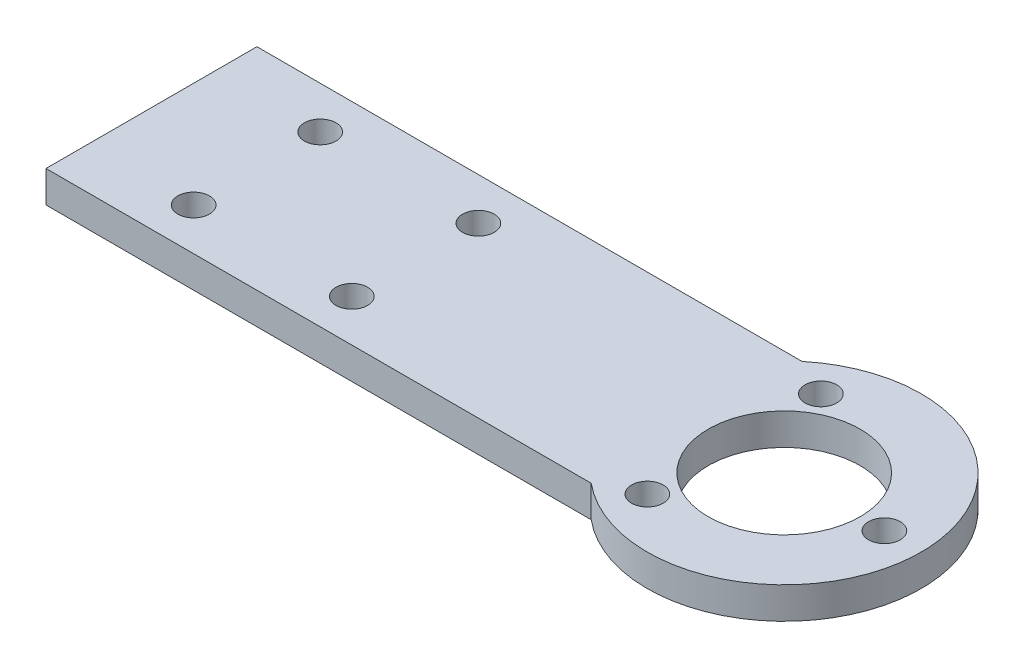
ISO-10303-21;
HEADER;
FILE_DESCRIPTION(('STEP AP214'),'2;1');
FILE_NAME('part.step','',(''),(''),'','','');
FILE_SCHEMA(('AUTOMOTIVE_DESIGN { 1 0 10303 214 1 1 1 1 }'));
ENDSEC;
DATA;
#1=APPLICATION_CONTEXT('core data for automotive mechanical design processes');
#2=APPLICATION_PROTOCOL_DEFINITION('international standard','automotive_design',2000,#1);
#3=PRODUCT_CONTEXT('',#1,'mechanical');
#4=PRODUCT('Part','Part','',(#3));
#5=PRODUCT_RELATED_PRODUCT_CATEGORY('part','',(#4));
#6=PRODUCT_DEFINITION_FORMATION('','',#4);
#7=PRODUCT_DEFINITION_CONTEXT('part definition',#1,'design');
#8=PRODUCT_DEFINITION('design','',#6,#7);
#9=PRODUCT_DEFINITION_SHAPE('','',#8);
#10=(LENGTH_UNIT() NAMED_UNIT(*) SI_UNIT(.MILLI.,.METRE.));
#11=(NAMED_UNIT(*) PLANE_ANGLE_UNIT() SI_UNIT($,.RADIAN.));
#12=(NAMED_UNIT(*) SI_UNIT($,.STERADIAN.) SOLID_ANGLE_UNIT());
#13=UNCERTAINTY_MEASURE_WITH_UNIT(LENGTH_MEASURE(1.E-05),#10,'distance_accuracy_value','');
#14=(GEOMETRIC_REPRESENTATION_CONTEXT(3) GLOBAL_UNCERTAINTY_ASSIGNED_CONTEXT((#13)) GLOBAL_UNIT_ASSIGNED_CONTEXT((#10,
#11,#12)) REPRESENTATION_CONTEXT('',''));
#15=CARTESIAN_POINT('',(0.,0.,0.));
#16=DIRECTION('',(0.,0.,1.));
#17=DIRECTION('',(1.,0.,0.));
#18=AXIS2_PLACEMENT_3D('',#15,#16,#17);
#19=CARTESIAN_POINT('',(1.41732283464566,3.,-1.5748031496063));
#20=DIRECTION('',(0.,1.,0.));
#21=DIRECTION('',(0.,0.,1.));
#22=AXIS2_PLACEMENT_3D('',#19,#20,#21);
#23=PLANE('',#22);
#24=CARTESIAN_POINT('',(-3.33267716535438,3.,6.65243818634584));
#25=DIRECTION('',(0.,1.,0.));
#26=DIRECTION('',(0.,0.,1.));
#27=AXIS2_PLACEMENT_3D('',#24,#25,#26);
#28=CIRCLE('',#27,1.5);
#29=CARTESIAN_POINT('',(-3.33267716535438,3.,8.15243818634584));
#30=VERTEX_POINT('',#29);
#31=EDGE_CURVE('E156',#30,#30,#28,.T.);
#32=ORIENTED_EDGE('',*,*,#31,.F.);
#33=EDGE_LOOP('',(#32));
#34=FACE_BOUND('',#33,.T.);
#35=CARTESIAN_POINT('',(-48.5826771653543,3.,4.4251968503937));
#36=DIRECTION('',(0.,1.,0.));
#37=DIRECTION('',(0.,0.,1.));
#38=AXIS2_PLACEMENT_3D('',#35,#36,#37);
#39=CIRCLE('',#38,1.5);
#40=CARTESIAN_POINT('',(-48.5826771653543,3.,5.9251968503937));
#41=VERTEX_POINT('',#40);
#42=EDGE_CURVE('E144',#41,#41,#39,.T.);
#43=ORIENTED_EDGE('',*,*,#42,.F.);
#44=EDGE_LOOP('',(#43));
#45=FACE_BOUND('',#44,.T.);
#46=CARTESIAN_POINT('',(-48.5826771653543,3.,-7.5748031496063));
#47=DIRECTION('',(0.,1.,0.));
#48=DIRECTION('',(0.,0.,1.));
#49=AXIS2_PLACEMENT_3D('',#46,#47,#48);
#50=CIRCLE('',#49,1.5);
#51=CARTESIAN_POINT('',(-48.5826771653543,3.,-6.0748031496063));
#52=VERTEX_POINT('',#51);
#53=EDGE_CURVE('E132',#52,#52,#50,.T.);
#54=ORIENTED_EDGE('',*,*,#53,.F.);
#55=EDGE_LOOP('',(#54));
#56=FACE_BOUND('',#55,.T.);
#57=CARTESIAN_POINT('',(10.9173228346457,3.,-1.5748031496063));
#58=DIRECTION('',(0.,1.,0.));
#59=DIRECTION('',(0.,0.,1.));
#60=AXIS2_PLACEMENT_3D('',#57,#58,#59);
#61=CIRCLE('',#60,1.5);
#62=CARTESIAN_POINT('',(10.9173228346457,3.,-0.0748031496062972));
#63=VERTEX_POINT('',#62);
#64=EDGE_CURVE('E111',#63,#63,#61,.T.);
#65=ORIENTED_EDGE('',*,*,#64,.F.);
#66=EDGE_LOOP('',(#65));
#67=FACE_BOUND('',#66,.T.);
#68=DIRECTION('',(0.,0.,1.));
#69=VECTOR('',#68,1.);
#70=CARTESIAN_POINT('',(-58.5826771653543,3.,-11.5748031496063));
#71=LINE('',#70,#69);
#72=CARTESIAN_POINT('',(-58.5826771653543,3.,-11.5748031496063));
#73=VERTEX_POINT('',#72);
#74=CARTESIAN_POINT('',(-58.5826771653543,3.,8.4251968503937));
#75=VERTEX_POINT('',#74);
#76=EDGE_CURVE('E96',#73,#75,#71,.T.);
#77=ORIENTED_EDGE('',*,*,#76,.T.);
#78=DIRECTION('',(1.,0.,0.));
#79=VECTOR('',#78,1.);
#80=CARTESIAN_POINT('',(-58.5826771653543,3.,8.4251968503937));
#81=LINE('',#80,#79);
#82=CARTESIAN_POINT('',(-6.88930102827243,3.,8.42519685039369));
#83=VERTEX_POINT('',#82);
#84=EDGE_CURVE('E91',#75,#83,#81,.T.);
#85=ORIENTED_EDGE('',*,*,#84,.T.);
#86=CARTESIAN_POINT('',(1.41732283464566,3.,-1.5748031496063));
#87=DIRECTION('',(0.,1.,0.));
#88=DIRECTION('',(0.,0.,1.));
#89=AXIS2_PLACEMENT_3D('',#86,#87,#88);
#90=CIRCLE('',#89,13.);
#91=CARTESIAN_POINT('',(-6.88930102827241,3.,-11.5748031496063));
#92=VERTEX_POINT('',#91);
#93=EDGE_CURVE('E94',#83,#92,#90,.T.);
#94=ORIENTED_EDGE('',*,*,#93,.T.);
#95=DIRECTION('',(-1.,0.,0.));
#96=VECTOR('',#95,1.);
#97=CARTESIAN_POINT('',(-58.5826771653543,3.,-11.5748031496063));
#98=LINE('',#97,#96);
#99=EDGE_CURVE('E61',#92,#73,#98,.T.);
#100=ORIENTED_EDGE('',*,*,#99,.T.);
#101=EDGE_LOOP('',(#77,#85,#94,#100));
#102=FACE_BOUND('',#101,.T.);
#103=CARTESIAN_POINT('',(-33.5826771653543,3.,-7.5748031496063));
#104=DIRECTION('',(0.,1.,0.));
#105=DIRECTION('',(0.,0.,1.));
#106=AXIS2_PLACEMENT_3D('',#103,#104,#105);
#107=CIRCLE('',#106,1.5);
#108=CARTESIAN_POINT('',(-33.5826771653543,3.,-6.0748031496063));
#109=VERTEX_POINT('',#108);
#110=EDGE_CURVE('E126',#109,#109,#107,.T.);
#111=ORIENTED_EDGE('',*,*,#110,.F.);
#112=EDGE_LOOP('',(#111));
#113=FACE_BOUND('',#112,.T.);
#114=CARTESIAN_POINT('',(-33.5826771653543,3.,4.4251968503937));
#115=DIRECTION('',(0.,1.,0.));
#116=DIRECTION('',(0.,0.,1.));
#117=AXIS2_PLACEMENT_3D('',#114,#115,#116);
#118=CIRCLE('',#117,1.5);
#119=CARTESIAN_POINT('',(-33.5826771653543,3.,5.9251968503937));
#120=VERTEX_POINT('',#119);
#121=EDGE_CURVE('E138',#120,#120,#118,.T.);
#122=ORIENTED_EDGE('',*,*,#121,.F.);
#123=EDGE_LOOP('',(#122));
#124=FACE_BOUND('',#123,.T.);
#125=CARTESIAN_POINT('',(1.41732283464566,3.,-1.5748031496063));
#126=DIRECTION('',(0.,1.,0.));
#127=DIRECTION('',(0.,0.,1.));
#128=AXIS2_PLACEMENT_3D('',#125,#126,#127);
#129=CIRCLE('',#128,7.2);
#130=CARTESIAN_POINT('',(1.41732283464566,3.,5.6251968503937));
#131=VERTEX_POINT('',#130);
#132=EDGE_CURVE('E150',#131,#131,#129,.T.);
#133=ORIENTED_EDGE('',*,*,#132,.F.);
#134=EDGE_LOOP('',(#133));
#135=FACE_BOUND('',#134,.T.);
#136=CARTESIAN_POINT('',(-3.33267716535426,3.,-9.80204448555851));
#137=DIRECTION('',(0.,1.,0.));
#138=DIRECTION('',(0.,0.,1.));
#139=AXIS2_PLACEMENT_3D('',#136,#137,#138);
#140=CIRCLE('',#139,1.5);
#141=CARTESIAN_POINT('',(-3.33267716535426,3.,-8.30204448555851));
#142=VERTEX_POINT('',#141);
#143=EDGE_CURVE('E162',#142,#142,#140,.T.);
#144=ORIENTED_EDGE('',*,*,#143,.F.);
#145=EDGE_LOOP('',(#144));
#146=FACE_BOUND('',#145,.T.);
#147=ADVANCED_FACE('F44',(#34,#45,#56,#67,#102,#113,#124,#135,#146),#23,.T.);
#148=CARTESIAN_POINT('',(1.41732283464566,0.,-1.5748031496063));
#149=DIRECTION('',(0.,1.,0.));
#150=DIRECTION('',(0.,0.,1.));
#151=AXIS2_PLACEMENT_3D('',#148,#149,#150);
#152=PLANE('',#151);
#153=DIRECTION('',(0.,0.,1.));
#154=VECTOR('',#153,1.);
#155=CARTESIAN_POINT('',(-58.5826771653543,0.,-11.5748031496063));
#156=LINE('',#155,#154);
#157=CARTESIAN_POINT('',(-58.5826771653543,0.,-11.5748031496063));
#158=VERTEX_POINT('',#157);
#159=CARTESIAN_POINT('',(-58.5826771653543,0.,8.4251968503937));
#160=VERTEX_POINT('',#159);
#161=EDGE_CURVE('E108',#158,#160,#156,.T.);
#162=ORIENTED_EDGE('',*,*,#161,.F.);
#163=DIRECTION('',(-1.,0.,0.));
#164=VECTOR('',#163,1.);
#165=CARTESIAN_POINT('',(-58.5826771653543,0.,-11.5748031496063));
#166=LINE('',#165,#164);
#167=CARTESIAN_POINT('',(-6.88930102827241,0.,-11.5748031496063));
#168=VERTEX_POINT('',#167);
#169=EDGE_CURVE('E84',#168,#158,#166,.T.);
#170=ORIENTED_EDGE('',*,*,#169,.F.);
#171=CARTESIAN_POINT('',(1.41732283464566,0.,-1.5748031496063));
#172=DIRECTION('',(0.,1.,0.));
#173=DIRECTION('',(0.,0.,1.));
#174=AXIS2_PLACEMENT_3D('',#171,#172,#173);
#175=CIRCLE('',#174,13.);
#176=CARTESIAN_POINT('',(-6.88930102827243,0.,8.42519685039369));
#177=VERTEX_POINT('',#176);
#178=EDGE_CURVE('E78',#177,#168,#175,.T.);
#179=ORIENTED_EDGE('',*,*,#178,.F.);
#180=DIRECTION('',(1.,0.,0.));
#181=VECTOR('',#180,1.);
#182=CARTESIAN_POINT('',(-58.5826771653543,0.,8.4251968503937));
#183=LINE('',#182,#181);
#184=EDGE_CURVE('E100',#160,#177,#183,.T.);
#185=ORIENTED_EDGE('',*,*,#184,.F.);
#186=EDGE_LOOP('',(#162,#170,#179,#185));
#187=FACE_BOUND('',#186,.T.);
#188=CARTESIAN_POINT('',(10.9173228346457,0.,-1.5748031496063));
#189=DIRECTION('',(0.,1.,0.));
#190=DIRECTION('',(0.,0.,1.));
#191=AXIS2_PLACEMENT_3D('',#188,#189,#190);
#192=CIRCLE('',#191,1.5);
#193=CARTESIAN_POINT('',(10.9173228346457,0.,-0.0748031496062972));
#194=VERTEX_POINT('',#193);
#195=EDGE_CURVE('E123',#194,#194,#192,.T.);
#196=ORIENTED_EDGE('',*,*,#195,.T.);
#197=EDGE_LOOP('',(#196));
#198=FACE_BOUND('',#197,.T.);
#199=CARTESIAN_POINT('',(-33.5826771653543,0.,-7.5748031496063));
#200=DIRECTION('',(0.,1.,0.));
#201=DIRECTION('',(0.,0.,1.));
#202=AXIS2_PLACEMENT_3D('',#199,#200,#201);
#203=CIRCLE('',#202,1.5);
#204=CARTESIAN_POINT('',(-33.5826771653543,0.,-6.0748031496063));
#205=VERTEX_POINT('',#204);
#206=EDGE_CURVE('E129',#205,#205,#203,.T.);
#207=ORIENTED_EDGE('',*,*,#206,.T.);
#208=EDGE_LOOP('',(#207));
#209=FACE_BOUND('',#208,.T.);
#210=CARTESIAN_POINT('',(-48.5826771653543,0.,-7.5748031496063));
#211=DIRECTION('',(0.,1.,0.));
#212=DIRECTION('',(0.,0.,1.));
#213=AXIS2_PLACEMENT_3D('',#210,#211,#212);
#214=CIRCLE('',#213,1.5);
#215=CARTESIAN_POINT('',(-48.5826771653543,0.,-6.0748031496063));
#216=VERTEX_POINT('',#215);
#217=EDGE_CURVE('E135',#216,#216,#214,.T.);
#218=ORIENTED_EDGE('',*,*,#217,.T.);
#219=EDGE_LOOP('',(#218));
#220=FACE_BOUND('',#219,.T.);
#221=CARTESIAN_POINT('',(-33.5826771653543,0.,4.4251968503937));
#222=DIRECTION('',(0.,1.,0.));
#223=DIRECTION('',(0.,0.,1.));
#224=AXIS2_PLACEMENT_3D('',#221,#222,#223);
#225=CIRCLE('',#224,1.5);
#226=CARTESIAN_POINT('',(-33.5826771653543,0.,5.9251968503937));
#227=VERTEX_POINT('',#226);
#228=EDGE_CURVE('E141',#227,#227,#225,.T.);
#229=ORIENTED_EDGE('',*,*,#228,.T.);
#230=EDGE_LOOP('',(#229));
#231=FACE_BOUND('',#230,.T.);
#232=CARTESIAN_POINT('',(-48.5826771653543,0.,4.4251968503937));
#233=DIRECTION('',(0.,1.,0.));
#234=DIRECTION('',(0.,0.,1.));
#235=AXIS2_PLACEMENT_3D('',#232,#233,#234);
#236=CIRCLE('',#235,1.5);
#237=CARTESIAN_POINT('',(-48.5826771653543,0.,5.9251968503937));
#238=VERTEX_POINT('',#237);
#239=EDGE_CURVE('E147',#238,#238,#236,.T.);
#240=ORIENTED_EDGE('',*,*,#239,.T.);
#241=EDGE_LOOP('',(#240));
#242=FACE_BOUND('',#241,.T.);
#243=CARTESIAN_POINT('',(1.41732283464566,0.,-1.5748031496063));
#244=DIRECTION('',(0.,1.,0.));
#245=DIRECTION('',(0.,0.,1.));
#246=AXIS2_PLACEMENT_3D('',#243,#244,#245);
#247=CIRCLE('',#246,7.2);
#248=CARTESIAN_POINT('',(1.41732283464566,0.,5.6251968503937));
#249=VERTEX_POINT('',#248);
#250=EDGE_CURVE('E153',#249,#249,#247,.T.);
#251=ORIENTED_EDGE('',*,*,#250,.T.);
#252=EDGE_LOOP('',(#251));
#253=FACE_BOUND('',#252,.T.);
#254=CARTESIAN_POINT('',(-3.33267716535438,0.,6.65243818634584));
#255=DIRECTION('',(0.,1.,0.));
#256=DIRECTION('',(0.,0.,1.));
#257=AXIS2_PLACEMENT_3D('',#254,#255,#256);
#258=CIRCLE('',#257,1.5);
#259=CARTESIAN_POINT('',(-3.33267716535438,0.,8.15243818634584));
#260=VERTEX_POINT('',#259);
#261=EDGE_CURVE('E159',#260,#260,#258,.T.);
#262=ORIENTED_EDGE('',*,*,#261,.T.);
#263=EDGE_LOOP('',(#262));
#264=FACE_BOUND('',#263,.T.);
#265=CARTESIAN_POINT('',(-3.33267716535426,0.,-9.80204448555851));
#266=DIRECTION('',(0.,1.,0.));
#267=DIRECTION('',(0.,0.,1.));
#268=AXIS2_PLACEMENT_3D('',#265,#266,#267);
#269=CIRCLE('',#268,1.5);
#270=CARTESIAN_POINT('',(-3.33267716535426,0.,-8.30204448555851));
#271=VERTEX_POINT('',#270);
#272=EDGE_CURVE('E165',#271,#271,#269,.T.);
#273=ORIENTED_EDGE('',*,*,#272,.T.);
#274=EDGE_LOOP('',(#273));
#275=FACE_BOUND('',#274,.T.);
#276=ADVANCED_FACE('F119',(#187,#198,#209,#220,#231,#242,#253,#264,#275),#152,.F.);
#277=CARTESIAN_POINT('',(-58.5826771653543,3.,-11.5748031496063));
#278=DIRECTION('',(1.,0.,0.));
#279=DIRECTION('',(0.,0.,-1.));
#280=AXIS2_PLACEMENT_3D('',#277,#278,#279);
#281=PLANE('',#280);
#282=ORIENTED_EDGE('',*,*,#161,.T.);
#283=DIRECTION('',(0.,-1.,0.));
#284=VECTOR('',#283,1.);
#285=CARTESIAN_POINT('',(-58.5826771653543,3.,8.4251968503937));
#286=LINE('',#285,#284);
#287=EDGE_CURVE('E13',#75,#160,#286,.T.);
#288=ORIENTED_EDGE('',*,*,#287,.F.);
#289=ORIENTED_EDGE('',*,*,#76,.F.);
#290=DIRECTION('',(0.,-1.,0.));
#291=VECTOR('',#290,1.);
#292=CARTESIAN_POINT('',(-58.5826771653543,3.,-11.5748031496063));
#293=LINE('',#292,#291);
#294=EDGE_CURVE('E104',#73,#158,#293,.T.);
#295=ORIENTED_EDGE('',*,*,#294,.T.);
#296=EDGE_LOOP('',(#282,#288,#289,#295));
#297=FACE_BOUND('',#296,.T.);
#298=ADVANCED_FACE('F46',(#297),#281,.F.);
#299=CARTESIAN_POINT('',(-58.5826771653543,3.,8.4251968503937));
#300=DIRECTION('',(0.,0.,-1.));
#301=DIRECTION('',(-1.,0.,0.));
#302=AXIS2_PLACEMENT_3D('',#299,#300,#301);
#303=PLANE('',#302);
#304=ORIENTED_EDGE('',*,*,#184,.T.);
#305=DIRECTION('',(0.,-1.,0.));
#306=VECTOR('',#305,1.);
#307=CARTESIAN_POINT('',(-6.88930102827243,3.,8.42519685039369));
#308=LINE('',#307,#306);
#309=EDGE_CURVE('E53',#83,#177,#308,.T.);
#310=ORIENTED_EDGE('',*,*,#309,.F.);
#311=ORIENTED_EDGE('',*,*,#84,.F.);
#312=ORIENTED_EDGE('',*,*,#287,.T.);
#313=EDGE_LOOP('',(#304,#310,#311,#312));
#314=FACE_BOUND('',#313,.T.);
#315=ADVANCED_FACE('F99',(#314),#303,.F.);
#316=CARTESIAN_POINT('',(1.41732283464566,3.,-1.5748031496063));
#317=DIRECTION('',(0.,-1.,0.));
#318=DIRECTION('',(0.,0.,-1.));
#319=AXIS2_PLACEMENT_3D('',#316,#317,#318);
#320=CYLINDRICAL_SURFACE('',#319,13.);
#321=ORIENTED_EDGE('',*,*,#178,.T.);
#322=DIRECTION('',(0.,-1.,0.));
#323=VECTOR('',#322,1.);
#324=CARTESIAN_POINT('',(-6.88930102827241,3.,-11.5748031496063));
#325=LINE('',#324,#323);
#326=EDGE_CURVE('E101',#92,#168,#325,.T.);
#327=ORIENTED_EDGE('',*,*,#326,.F.);
#328=ORIENTED_EDGE('',*,*,#93,.F.);
#329=ORIENTED_EDGE('',*,*,#309,.T.);
#330=EDGE_LOOP('',(#321,#327,#328,#329));
#331=FACE_BOUND('',#330,.T.);
#332=ADVANCED_FACE('F102',(#331),#320,.T.);
#333=CARTESIAN_POINT('',(-58.5826771653543,3.,-11.5748031496063));
#334=DIRECTION('',(0.,0.,1.));
#335=DIRECTION('',(1.,0.,0.));
#336=AXIS2_PLACEMENT_3D('',#333,#334,#335);
#337=PLANE('',#336);
#338=ORIENTED_EDGE('',*,*,#169,.T.);
#339=ORIENTED_EDGE('',*,*,#294,.F.);
#340=ORIENTED_EDGE('',*,*,#99,.F.);
#341=ORIENTED_EDGE('',*,*,#326,.T.);
#342=EDGE_LOOP('',(#338,#339,#340,#341));
#343=FACE_BOUND('',#342,.T.);
#344=ADVANCED_FACE('F116',(#343),#337,.F.);
#345=CARTESIAN_POINT('',(10.9173228346457,3.,-1.5748031496063));
#346=DIRECTION('',(0.,-1.,0.));
#347=DIRECTION('',(0.,0.,-1.));
#348=AXIS2_PLACEMENT_3D('',#345,#346,#347);
#349=CYLINDRICAL_SURFACE('',#348,1.5);
#350=ORIENTED_EDGE('',*,*,#64,.T.);
#351=EDGE_LOOP('',(#350));
#352=FACE_BOUND('',#351,.T.);
#353=ORIENTED_EDGE('',*,*,#195,.F.);
#354=EDGE_LOOP('',(#353));
#355=FACE_BOUND('',#354,.T.);
#356=ADVANCED_FACE('F184',(#352,#355),#349,.F.);
#357=CARTESIAN_POINT('',(-33.5826771653543,3.,-7.5748031496063));
#358=DIRECTION('',(0.,-1.,0.));
#359=DIRECTION('',(0.,0.,-1.));
#360=AXIS2_PLACEMENT_3D('',#357,#358,#359);
#361=CYLINDRICAL_SURFACE('',#360,1.5);
#362=ORIENTED_EDGE('',*,*,#110,.T.);
#363=EDGE_LOOP('',(#362));
#364=FACE_BOUND('',#363,.T.);
#365=ORIENTED_EDGE('',*,*,#206,.F.);
#366=EDGE_LOOP('',(#365));
#367=FACE_BOUND('',#366,.T.);
#368=ADVANCED_FACE('F230',(#364,#367),#361,.F.);
#369=CARTESIAN_POINT('',(-48.5826771653543,3.,-7.5748031496063));
#370=DIRECTION('',(0.,-1.,0.));
#371=DIRECTION('',(0.,0.,-1.));
#372=AXIS2_PLACEMENT_3D('',#369,#370,#371);
#373=CYLINDRICAL_SURFACE('',#372,1.5);
#374=ORIENTED_EDGE('',*,*,#53,.T.);
#375=EDGE_LOOP('',(#374));
#376=FACE_BOUND('',#375,.T.);
#377=ORIENTED_EDGE('',*,*,#217,.F.);
#378=EDGE_LOOP('',(#377));
#379=FACE_BOUND('',#378,.T.);
#380=ADVANCED_FACE('F238',(#376,#379),#373,.F.);
#381=CARTESIAN_POINT('',(-33.5826771653543,3.,4.4251968503937));
#382=DIRECTION('',(0.,-1.,0.));
#383=DIRECTION('',(0.,0.,-1.));
#384=AXIS2_PLACEMENT_3D('',#381,#382,#383);
#385=CYLINDRICAL_SURFACE('',#384,1.5);
#386=ORIENTED_EDGE('',*,*,#121,.T.);
#387=EDGE_LOOP('',(#386));
#388=FACE_BOUND('',#387,.T.);
#389=ORIENTED_EDGE('',*,*,#228,.F.);
#390=EDGE_LOOP('',(#389));
#391=FACE_BOUND('',#390,.T.);
#392=ADVANCED_FACE('F246',(#388,#391),#385,.F.);
#393=CARTESIAN_POINT('',(-48.5826771653543,3.,4.4251968503937));
#394=DIRECTION('',(0.,-1.,0.));
#395=DIRECTION('',(0.,0.,-1.));
#396=AXIS2_PLACEMENT_3D('',#393,#394,#395);
#397=CYLINDRICAL_SURFACE('',#396,1.5);
#398=ORIENTED_EDGE('',*,*,#42,.T.);
#399=EDGE_LOOP('',(#398));
#400=FACE_BOUND('',#399,.T.);
#401=ORIENTED_EDGE('',*,*,#239,.F.);
#402=EDGE_LOOP('',(#401));
#403=FACE_BOUND('',#402,.T.);
#404=ADVANCED_FACE('F255',(#400,#403),#397,.F.);
#405=CARTESIAN_POINT('',(1.41732283464566,3.,-1.5748031496063));
#406=DIRECTION('',(0.,-1.,0.));
#407=DIRECTION('',(0.,0.,-1.));
#408=AXIS2_PLACEMENT_3D('',#405,#406,#407);
#409=CYLINDRICAL_SURFACE('',#408,7.2);
#410=ORIENTED_EDGE('',*,*,#132,.T.);
#411=EDGE_LOOP('',(#410));
#412=FACE_BOUND('',#411,.T.);
#413=ORIENTED_EDGE('',*,*,#250,.F.);
#414=EDGE_LOOP('',(#413));
#415=FACE_BOUND('',#414,.T.);
#416=ADVANCED_FACE('F264',(#412,#415),#409,.F.);
#417=CARTESIAN_POINT('',(-3.33267716535438,3.,6.65243818634584));
#418=DIRECTION('',(0.,-1.,0.));
#419=DIRECTION('',(0.,0.,-1.));
#420=AXIS2_PLACEMENT_3D('',#417,#418,#419);
#421=CYLINDRICAL_SURFACE('',#420,1.5);
#422=ORIENTED_EDGE('',*,*,#31,.T.);
#423=EDGE_LOOP('',(#422));
#424=FACE_BOUND('',#423,.T.);
#425=ORIENTED_EDGE('',*,*,#261,.F.);
#426=EDGE_LOOP('',(#425));
#427=FACE_BOUND('',#426,.T.);
#428=ADVANCED_FACE('F273',(#424,#427),#421,.F.);
#429=CARTESIAN_POINT('',(-3.33267716535426,3.,-9.80204448555851));
#430=DIRECTION('',(0.,-1.,0.));
#431=DIRECTION('',(0.,0.,-1.));
#432=AXIS2_PLACEMENT_3D('',#429,#430,#431);
#433=CYLINDRICAL_SURFACE('',#432,1.5);
#434=ORIENTED_EDGE('',*,*,#143,.T.);
#435=EDGE_LOOP('',(#434));
#436=FACE_BOUND('',#435,.T.);
#437=ORIENTED_EDGE('',*,*,#272,.F.);
#438=EDGE_LOOP('',(#437));
#439=FACE_BOUND('',#438,.T.);
#440=ADVANCED_FACE('F171',(#436,#439),#433,.F.);
#441=CLOSED_SHELL('',(#147,#276,#298,#315,#332,#344,#356,#368,#380,#392,#404,#416,#428,#440));
#442=MANIFOLD_SOLID_BREP('B2',#441);
#443=ADVANCED_BREP_SHAPE_REPRESENTATION('',(#18,#442),#14);
#444=SHAPE_DEFINITION_REPRESENTATION(#9,#443);
ENDSEC;
END-ISO-10303-21;
